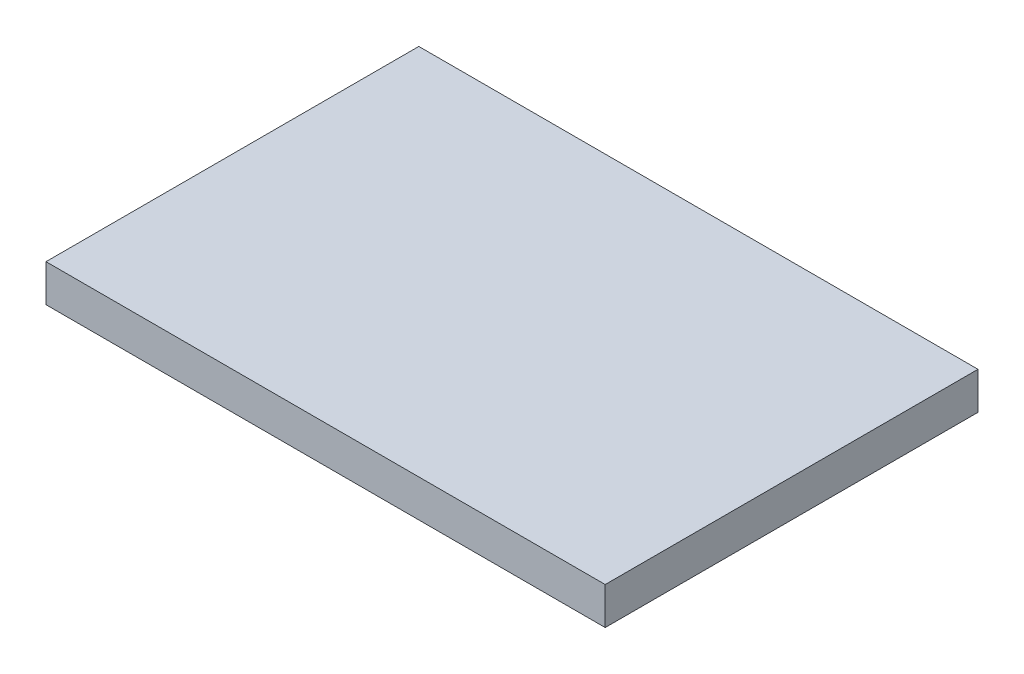
ISO-10303-21;
HEADER;
FILE_DESCRIPTION(('STEP AP214'),'2;1');
FILE_NAME('part.step','',(''),(''),'','','');
FILE_SCHEMA(('AUTOMOTIVE_DESIGN { 1 0 10303 214 1 1 1 1 }'));
ENDSEC;
DATA;
#1=APPLICATION_CONTEXT('core data for automotive mechanical design processes');
#2=APPLICATION_PROTOCOL_DEFINITION('international standard','automotive_design',2000,#1);
#3=PRODUCT_CONTEXT('',#1,'mechanical');
#4=PRODUCT('Part','Part','',(#3));
#5=PRODUCT_RELATED_PRODUCT_CATEGORY('part','',(#4));
#6=PRODUCT_DEFINITION_FORMATION('','',#4);
#7=PRODUCT_DEFINITION_CONTEXT('part definition',#1,'design');
#8=PRODUCT_DEFINITION('design','',#6,#7);
#9=PRODUCT_DEFINITION_SHAPE('','',#8);
#10=(LENGTH_UNIT() NAMED_UNIT(*) SI_UNIT(.MILLI.,.METRE.));
#11=(NAMED_UNIT(*) PLANE_ANGLE_UNIT() SI_UNIT($,.RADIAN.));
#12=(NAMED_UNIT(*) SI_UNIT($,.STERADIAN.) SOLID_ANGLE_UNIT());
#13=UNCERTAINTY_MEASURE_WITH_UNIT(LENGTH_MEASURE(1.E-05),#10,'distance_accuracy_value','');
#14=(GEOMETRIC_REPRESENTATION_CONTEXT(3) GLOBAL_UNCERTAINTY_ASSIGNED_CONTEXT((#13)) GLOBAL_UNIT_ASSIGNED_CONTEXT((#10,
#11,#12)) REPRESENTATION_CONTEXT('',''));
#15=CARTESIAN_POINT('',(0.,0.,0.));
#16=DIRECTION('',(0.,0.,1.));
#17=DIRECTION('',(1.,0.,0.));
#18=AXIS2_PLACEMENT_3D('',#15,#16,#17);
#19=CARTESIAN_POINT('',(-1.8450184501845,4.,-19.9261992619926));
#20=DIRECTION('',(-1.,0.,0.));
#21=DIRECTION('',(0.,0.,1.));
#22=AXIS2_PLACEMENT_3D('',#19,#20,#21);
#23=PLANE('',#22);
#24=DIRECTION('',(0.,0.,-1.));
#25=VECTOR('',#24,1.);
#26=CARTESIAN_POINT('',(-1.8450184501845,0.,-19.9261992619926));
#27=LINE('',#26,#25);
#28=CARTESIAN_POINT('',(-1.8450184501845,0.,20.0738007380074));
#29=VERTEX_POINT('',#28);
#30=CARTESIAN_POINT('',(-1.8450184501845,0.,-19.9261992619926));
#31=VERTEX_POINT('',#30);
#32=EDGE_CURVE('E107',#29,#31,#27,.T.);
#33=ORIENTED_EDGE('',*,*,#32,.T.);
#34=DIRECTION('',(0.,-1.,0.));
#35=VECTOR('',#34,1.);
#36=CARTESIAN_POINT('',(-1.8450184501845,4.,-19.9261992619926));
#37=LINE('',#36,#35);
#38=CARTESIAN_POINT('',(-1.8450184501845,4.,-19.9261992619926));
#39=VERTEX_POINT('',#38);
#40=EDGE_CURVE('E11',#39,#31,#37,.T.);
#41=ORIENTED_EDGE('',*,*,#40,.F.);
#42=DIRECTION('',(0.,0.,-1.));
#43=VECTOR('',#42,1.);
#44=CARTESIAN_POINT('',(-1.8450184501845,4.,-19.9261992619926));
#45=LINE('',#44,#43);
#46=CARTESIAN_POINT('',(-1.8450184501845,4.,20.0738007380074));
#47=VERTEX_POINT('',#46);
#48=EDGE_CURVE('E91',#47,#39,#45,.T.);
#49=ORIENTED_EDGE('',*,*,#48,.F.);
#50=DIRECTION('',(0.,-1.,0.));
#51=VECTOR('',#50,1.);
#52=CARTESIAN_POINT('',(-1.8450184501845,4.,20.0738007380074));
#53=LINE('',#52,#51);
#54=EDGE_CURVE('E103',#47,#29,#53,.T.);
#55=ORIENTED_EDGE('',*,*,#54,.T.);
#56=EDGE_LOOP('',(#33,#41,#49,#55));
#57=FACE_BOUND('',#56,.T.);
#58=ADVANCED_FACE('F39',(#57),#23,.F.);
#59=CARTESIAN_POINT('',(-61.8450184501845,4.,-19.9261992619926));
#60=DIRECTION('',(0.,0.,1.));
#61=DIRECTION('',(1.,0.,0.));
#62=AXIS2_PLACEMENT_3D('',#59,#60,#61);
#63=PLANE('',#62);
#64=DIRECTION('',(-1.,0.,0.));
#65=VECTOR('',#64,1.);
#66=CARTESIAN_POINT('',(-61.8450184501845,0.,-19.9261992619926));
#67=LINE('',#66,#65);
#68=CARTESIAN_POINT('',(-61.8450184501845,0.,-19.9261992619926));
#69=VERTEX_POINT('',#68);
#70=EDGE_CURVE('E96',#31,#69,#67,.T.);
#71=ORIENTED_EDGE('',*,*,#70,.T.);
#72=DIRECTION('',(0.,-1.,0.));
#73=VECTOR('',#72,1.);
#74=CARTESIAN_POINT('',(-61.8450184501845,4.,-19.9261992619926));
#75=LINE('',#74,#73);
#76=CARTESIAN_POINT('',(-61.8450184501845,4.,-19.9261992619926));
#77=VERTEX_POINT('',#76);
#78=EDGE_CURVE('E48',#77,#69,#75,.T.);
#79=ORIENTED_EDGE('',*,*,#78,.F.);
#80=DIRECTION('',(-1.,0.,0.));
#81=VECTOR('',#80,1.);
#82=CARTESIAN_POINT('',(-61.8450184501845,4.,-19.9261992619926));
#83=LINE('',#82,#81);
#84=EDGE_CURVE('E86',#39,#77,#83,.T.);
#85=ORIENTED_EDGE('',*,*,#84,.F.);
#86=ORIENTED_EDGE('',*,*,#40,.T.);
#87=EDGE_LOOP('',(#71,#79,#85,#86));
#88=FACE_BOUND('',#87,.T.);
#89=ADVANCED_FACE('F95',(#88),#63,.F.);
#90=CARTESIAN_POINT('',(-61.8450184501845,4.,-19.9261992619926));
#91=DIRECTION('',(1.,0.,0.));
#92=DIRECTION('',(0.,0.,-1.));
#93=AXIS2_PLACEMENT_3D('',#90,#91,#92);
#94=PLANE('',#93);
#95=DIRECTION('',(0.,0.,1.));
#96=VECTOR('',#95,1.);
#97=CARTESIAN_POINT('',(-61.8450184501845,0.,-19.9261992619926));
#98=LINE('',#97,#96);
#99=CARTESIAN_POINT('',(-61.8450184501845,0.,20.0738007380074));
#100=VERTEX_POINT('',#99);
#101=EDGE_CURVE('E73',#69,#100,#98,.T.);
#102=ORIENTED_EDGE('',*,*,#101,.T.);
#103=DIRECTION('',(0.,-1.,0.));
#104=VECTOR('',#103,1.);
#105=CARTESIAN_POINT('',(-61.8450184501845,4.,20.0738007380074));
#106=LINE('',#105,#104);
#107=CARTESIAN_POINT('',(-61.8450184501845,4.,20.0738007380074));
#108=VERTEX_POINT('',#107);
#109=EDGE_CURVE('E98',#108,#100,#106,.T.);
#110=ORIENTED_EDGE('',*,*,#109,.F.);
#111=DIRECTION('',(0.,0.,1.));
#112=VECTOR('',#111,1.);
#113=CARTESIAN_POINT('',(-61.8450184501845,4.,-19.9261992619926));
#114=LINE('',#113,#112);
#115=EDGE_CURVE('E89',#77,#108,#114,.T.);
#116=ORIENTED_EDGE('',*,*,#115,.F.);
#117=ORIENTED_EDGE('',*,*,#78,.T.);
#118=EDGE_LOOP('',(#102,#110,#116,#117));
#119=FACE_BOUND('',#118,.T.);
#120=ADVANCED_FACE('F99',(#119),#94,.F.);
#121=CARTESIAN_POINT('',(-61.8450184501845,4.,20.0738007380074));
#122=DIRECTION('',(0.,0.,-1.));
#123=DIRECTION('',(-1.,0.,0.));
#124=AXIS2_PLACEMENT_3D('',#121,#122,#123);
#125=PLANE('',#124);
#126=DIRECTION('',(1.,0.,0.));
#127=VECTOR('',#126,1.);
#128=CARTESIAN_POINT('',(-61.8450184501845,0.,20.0738007380074));
#129=LINE('',#128,#127);
#130=EDGE_CURVE('E79',#100,#29,#129,.T.);
#131=ORIENTED_EDGE('',*,*,#130,.T.);
#132=ORIENTED_EDGE('',*,*,#54,.F.);
#133=DIRECTION('',(1.,0.,0.));
#134=VECTOR('',#133,1.);
#135=CARTESIAN_POINT('',(-61.8450184501845,4.,20.0738007380074));
#136=LINE('',#135,#134);
#137=EDGE_CURVE('E56',#108,#47,#136,.T.);
#138=ORIENTED_EDGE('',*,*,#137,.F.);
#139=ORIENTED_EDGE('',*,*,#109,.T.);
#140=EDGE_LOOP('',(#131,#132,#138,#139));
#141=FACE_BOUND('',#140,.T.);
#142=ADVANCED_FACE('F120',(#141),#125,.F.);
#143=CARTESIAN_POINT('',(0.,4.,0.));
#144=DIRECTION('',(0.,1.,0.));
#145=DIRECTION('',(0.,0.,1.));
#146=AXIS2_PLACEMENT_3D('',#143,#144,#145);
#147=PLANE('',#146);
#148=ORIENTED_EDGE('',*,*,#48,.T.);
#149=ORIENTED_EDGE('',*,*,#84,.T.);
#150=ORIENTED_EDGE('',*,*,#115,.T.);
#151=ORIENTED_EDGE('',*,*,#137,.T.);
#152=EDGE_LOOP('',(#148,#149,#150,#151));
#153=FACE_BOUND('',#152,.T.);
#154=ADVANCED_FACE('F87',(#153),#147,.T.);
#155=CARTESIAN_POINT('',(0.,0.,0.));
#156=DIRECTION('',(0.,1.,0.));
#157=DIRECTION('',(0.,0.,1.));
#158=AXIS2_PLACEMENT_3D('',#155,#156,#157);
#159=PLANE('',#158);
#160=ORIENTED_EDGE('',*,*,#32,.F.);
#161=ORIENTED_EDGE('',*,*,#130,.F.);
#162=ORIENTED_EDGE('',*,*,#101,.F.);
#163=ORIENTED_EDGE('',*,*,#70,.F.);
#164=EDGE_LOOP('',(#160,#161,#162,#163));
#165=FACE_BOUND('',#164,.T.);
#166=ADVANCED_FACE('F123',(#165),#159,.F.);
#167=CLOSED_SHELL('',(#58,#89,#120,#142,#154,#166));
#168=MANIFOLD_SOLID_BREP('B2',#167);
#169=ADVANCED_BREP_SHAPE_REPRESENTATION('',(#18,#168),#14);
#170=SHAPE_DEFINITION_REPRESENTATION(#9,#169);
ENDSEC;
END-ISO-10303-21;
